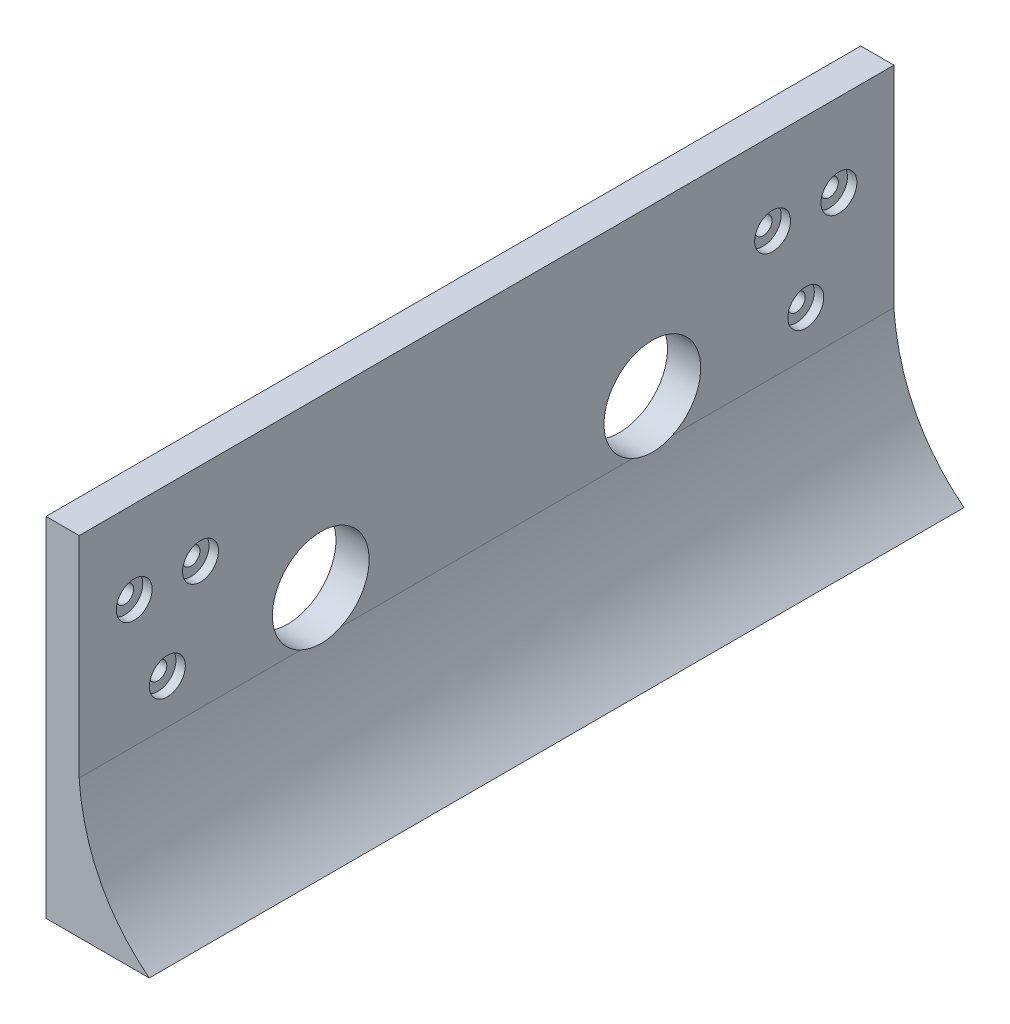
ISO-10303-21;
HEADER;
FILE_DESCRIPTION(('STEP AP214'),'2;1');
FILE_NAME('part.step','',(''),(''),'','','');
FILE_SCHEMA(('AUTOMOTIVE_DESIGN { 1 0 10303 214 1 1 1 1 }'));
ENDSEC;
DATA;
#1=APPLICATION_CONTEXT('core data for automotive mechanical design processes');
#2=APPLICATION_PROTOCOL_DEFINITION('international standard','automotive_design',2000,#1);
#3=PRODUCT_CONTEXT('',#1,'mechanical');
#4=PRODUCT('Part','Part','',(#3));
#5=PRODUCT_RELATED_PRODUCT_CATEGORY('part','',(#4));
#6=PRODUCT_DEFINITION_FORMATION('','',#4);
#7=PRODUCT_DEFINITION_CONTEXT('part definition',#1,'design');
#8=PRODUCT_DEFINITION('design','',#6,#7);
#9=PRODUCT_DEFINITION_SHAPE('','',#8);
#10=(LENGTH_UNIT() NAMED_UNIT(*) SI_UNIT(.MILLI.,.METRE.));
#11=(NAMED_UNIT(*) PLANE_ANGLE_UNIT() SI_UNIT($,.RADIAN.));
#12=(NAMED_UNIT(*) SI_UNIT($,.STERADIAN.) SOLID_ANGLE_UNIT());
#13=UNCERTAINTY_MEASURE_WITH_UNIT(LENGTH_MEASURE(1.E-05),#10,'distance_accuracy_value','');
#14=(GEOMETRIC_REPRESENTATION_CONTEXT(3) GLOBAL_UNCERTAINTY_ASSIGNED_CONTEXT((#13)) GLOBAL_UNIT_ASSIGNED_CONTEXT((#10,
#11,#12)) REPRESENTATION_CONTEXT('',''));
#15=CARTESIAN_POINT('',(0.,0.,0.));
#16=DIRECTION('',(0.,0.,1.));
#17=DIRECTION('',(1.,0.,0.));
#18=AXIS2_PLACEMENT_3D('',#15,#16,#17);
#19=CARTESIAN_POINT('',(92.7248750291424,42.,57.7615337539128));
#20=DIRECTION('',(-1.,0.,0.));
#21=DIRECTION('',(0.,0.,1.));
#22=AXIS2_PLACEMENT_3D('',#19,#20,#21);
#23=CYLINDRICAL_SURFACE('',#22,1.6);
#24=CARTESIAN_POINT('',(86.3248750291424,42.,57.7615337539128));
#25=DIRECTION('',(-1.,0.,0.));
#26=DIRECTION('',(0.,0.,1.));
#27=AXIS2_PLACEMENT_3D('',#24,#25,#26);
#28=CIRCLE('',#27,1.6);
#29=CARTESIAN_POINT('',(86.3248750291424,42.,59.3615337539128));
#30=VERTEX_POINT('',#29);
#31=EDGE_CURVE('E282',#30,#30,#28,.F.);
#32=ORIENTED_EDGE('',*,*,#31,.F.);
#33=EDGE_LOOP('',(#32));
#34=FACE_BOUND('',#33,.T.);
#35=CARTESIAN_POINT('',(90.6248750291424,42.,57.7615337539128));
#36=DIRECTION('',(1.,0.,0.));
#37=DIRECTION('',(0.,0.,-1.));
#38=AXIS2_PLACEMENT_3D('',#35,#36,#37);
#39=CIRCLE('',#38,1.6);
#40=CARTESIAN_POINT('',(90.6248750291424,42.,56.1615337539128));
#41=VERTEX_POINT('',#40);
#42=EDGE_CURVE('E548',#41,#41,#39,.T.);
#43=ORIENTED_EDGE('',*,*,#42,.T.);
#44=EDGE_LOOP('',(#43));
#45=FACE_BOUND('',#44,.T.);
#46=ADVANCED_FACE('F52',(#34,#45),#23,.F.);
#47=CARTESIAN_POINT('',(92.7248750291424,57.,63.7615337539128));
#48=DIRECTION('',(-1.,0.,0.));
#49=DIRECTION('',(0.,0.,1.));
#50=AXIS2_PLACEMENT_3D('',#47,#48,#49);
#51=CYLINDRICAL_SURFACE('',#50,1.60000000000001);
#52=CARTESIAN_POINT('',(86.3248750291424,57.,63.7615337539128));
#53=DIRECTION('',(-1.,0.,0.));
#54=DIRECTION('',(0.,0.,1.));
#55=AXIS2_PLACEMENT_3D('',#52,#53,#54);
#56=CIRCLE('',#55,1.60000000000001);
#57=CARTESIAN_POINT('',(86.3248750291424,57.,65.3615337539128));
#58=VERTEX_POINT('',#57);
#59=EDGE_CURVE('E279',#58,#58,#56,.F.);
#60=ORIENTED_EDGE('',*,*,#59,.F.);
#61=EDGE_LOOP('',(#60));
#62=FACE_BOUND('',#61,.T.);
#63=CARTESIAN_POINT('',(90.6248750291424,57.,63.7615337539128));
#64=DIRECTION('',(1.,0.,0.));
#65=DIRECTION('',(0.,0.,-1.));
#66=AXIS2_PLACEMENT_3D('',#63,#64,#65);
#67=CIRCLE('',#66,1.60000000000001);
#68=CARTESIAN_POINT('',(90.6248750291424,57.,62.1615337539128));
#69=VERTEX_POINT('',#68);
#70=EDGE_CURVE('E256',#69,#69,#67,.T.);
#71=ORIENTED_EDGE('',*,*,#70,.T.);
#72=EDGE_LOOP('',(#71));
#73=FACE_BOUND('',#72,.T.);
#74=ADVANCED_FACE('F178',(#62,#73),#51,.F.);
#75=CARTESIAN_POINT('',(92.7248750291424,57.,51.7615337539128));
#76=DIRECTION('',(-1.,0.,0.));
#77=DIRECTION('',(0.,0.,1.));
#78=AXIS2_PLACEMENT_3D('',#75,#76,#77);
#79=CYLINDRICAL_SURFACE('',#78,1.60000000000001);
#80=CARTESIAN_POINT('',(86.3248750291424,57.,51.7615337539128));
#81=DIRECTION('',(-1.,0.,0.));
#82=DIRECTION('',(0.,0.,1.));
#83=AXIS2_PLACEMENT_3D('',#80,#81,#82);
#84=CIRCLE('',#83,1.60000000000001);
#85=CARTESIAN_POINT('',(86.3248750291424,57.,53.3615337539128));
#86=VERTEX_POINT('',#85);
#87=EDGE_CURVE('E283',#86,#86,#84,.F.);
#88=ORIENTED_EDGE('',*,*,#87,.F.);
#89=EDGE_LOOP('',(#88));
#90=FACE_BOUND('',#89,.T.);
#91=CARTESIAN_POINT('',(90.6248750291424,57.,51.7615337539128));
#92=DIRECTION('',(1.,0.,0.));
#93=DIRECTION('',(0.,0.,-1.));
#94=AXIS2_PLACEMENT_3D('',#91,#92,#93);
#95=CIRCLE('',#94,1.60000000000001);
#96=CARTESIAN_POINT('',(90.6248750291424,57.,50.1615337539128));
#97=VERTEX_POINT('',#96);
#98=EDGE_CURVE('E549',#97,#97,#95,.T.);
#99=ORIENTED_EDGE('',*,*,#98,.T.);
#100=EDGE_LOOP('',(#99));
#101=FACE_BOUND('',#100,.T.);
#102=ADVANCED_FACE('F183',(#90,#101),#79,.F.);
#103=CARTESIAN_POINT('',(105.,9.,-73.7179107017961));
#104=CARTESIAN_POINT('',(93.4397317254562,18.2271976613418,-73.7179107017961));
#105=CARTESIAN_POINT('',(92.3248750291424,34.,-73.7179107017961));
#106=B_SPLINE_CURVE_WITH_KNOTS('',2,(#103,#104,#105),.UNSPECIFIED.,.F.,.F.,(3,3),(0.,1.),.UNSPECIFIED.);
#107=DIRECTION('',(0.,0.,1.));
#108=VECTOR('',#107,1.);
#109=SURFACE_OF_LINEAR_EXTRUSION('',#106,#108);
#110=DIRECTION('',(0.,0.,1.));
#111=VECTOR('',#110,1.);
#112=CARTESIAN_POINT('',(92.3248750291424,34.,-73.7179107017961));
#113=LINE('',#112,#111);
#114=CARTESIAN_POINT('',(92.3248750291424,34.,-73.7179107017961));
#115=VERTEX_POINT('',#114);
#116=CARTESIAN_POINT('',(92.3248750291424,34.,-33.5443617196896));
#117=VERTEX_POINT('',#116);
#118=EDGE_CURVE('E126',#115,#117,#113,.T.);
#119=ORIENTED_EDGE('',*,*,#118,.T.);
#120=CARTESIAN_POINT('',(92.3248750291424,34.,-33.5443617196896));
#121=CARTESIAN_POINT('',(92.3319106132641,33.9006090274986,-33.3200898688275));
#122=CARTESIAN_POINT('',(92.3385812050402,33.8106928153023,-33.0916108543302));
#123=CARTESIAN_POINT('',(92.3508617682079,33.6503430133056,-32.6278877371185));
#124=CARTESIAN_POINT('',(92.3564717402337,33.5799094118559,-32.3926436384492));
#125=CARTESIAN_POINT('',(92.366300735324,33.4590541499445,-31.917024904046));
#126=CARTESIAN_POINT('',(92.3705196740474,33.4086337028816,-31.6766499581592));
#127=CARTESIAN_POINT('',(92.3773348220622,33.3281694599186,-31.1925023488931));
#128=CARTESIAN_POINT('',(92.3799311085502,33.2981246946518,-30.9487298477146));
#129=CARTESIAN_POINT('',(92.3833581527275,33.2586119125735,-30.4593050437774));
#130=CARTESIAN_POINT('',(92.3841874338878,33.2491611041482,-30.2136513409309));
#131=CARTESIAN_POINT('',(92.384030638545,33.2509556636418,-29.7224201128998));
#132=CARTESIAN_POINT('',(92.3830445633017,33.2622010171973,-29.4768425876625));
#133=CARTESIAN_POINT('',(92.379313632492,33.3052781315904,-28.9878343601948));
#134=CARTESIAN_POINT('',(92.3765710507919,33.3370832774688,-28.7444012943092));
#135=CARTESIAN_POINT('',(92.369482857232,33.421007424925,-28.2611765949328));
#136=CARTESIAN_POINT('',(92.3651378393386,33.4731189000702,-28.0213836464251));
#137=CARTESIAN_POINT('',(92.3552913228563,33.5947185503601,-27.5568547255122));
#138=CARTESIAN_POINT('',(92.3498450113087,33.6633999938459,-27.3319059536168));
#139=CARTESIAN_POINT('',(92.3380006381269,33.8185142044853,-26.8885749240636));
#140=CARTESIAN_POINT('',(92.3316038460145,33.9049233511372,-26.6701843675524));
#141=CARTESIAN_POINT('',(92.3248750291424,34.,-26.4556382803107));
#142=B_SPLINE_CURVE_WITH_KNOTS('',3,(#120,#121,#122,#123,#124,#125,#126,#127,#128,#129,#130,
#131,#132,#133,#134,#135,#136,#137,#138,#139,#140,#141),.UNSPECIFIED.,.F.,.F.,(4,2,2,2,2,2,2,2,
2,2,4),(0.,0.736008665259869,1.47201689043756,2.20806973302774,2.94408755567597,
3.68072016206232,4.4173522572174,5.15303267553852,5.8884406768057,6.59346995340096,
7.29756587532268),.UNSPECIFIED.);
#143=CARTESIAN_POINT('',(92.3248750291424,34.,-26.4556382803107));
#144=VERTEX_POINT('',#143);
#145=EDGE_CURVE('E12',#117,#144,#142,.T.);
#146=ORIENTED_EDGE('',*,*,#145,.T.);
#147=CARTESIAN_POINT('',(92.3248750291424,34.,26.4556382803104));
#148=VERTEX_POINT('',#147);
#149=EDGE_CURVE('E119',#144,#148,#113,.T.);
#150=ORIENTED_EDGE('',*,*,#149,.T.);
#151=CARTESIAN_POINT('',(92.3248750291424,34.,26.4556382803104));
#152=CARTESIAN_POINT('',(92.3319106132641,33.9006090274986,26.6799101311725));
#153=CARTESIAN_POINT('',(92.3385812050402,33.8106928153023,26.9083891456698));
#154=CARTESIAN_POINT('',(92.3508617682079,33.6503430133056,27.3721122628815));
#155=CARTESIAN_POINT('',(92.3564717402337,33.5799094118559,27.6073563615507));
#156=CARTESIAN_POINT('',(92.366300735324,33.4590541499445,28.0829750959539));
#157=CARTESIAN_POINT('',(92.3705196740474,33.4086337028816,28.3233500418407));
#158=CARTESIAN_POINT('',(92.3773348220622,33.3281694599186,28.8074976511068));
#159=CARTESIAN_POINT('',(92.3799311085502,33.2981246946518,29.0512701522854));
#160=CARTESIAN_POINT('',(92.3833581527275,33.2586119125735,29.5406949562225));
#161=CARTESIAN_POINT('',(92.3841874338878,33.2491611041482,29.7863486590691));
#162=CARTESIAN_POINT('',(92.384030638545,33.2509556636417,30.2775798871002));
#163=CARTESIAN_POINT('',(92.3830445633017,33.2622010171973,30.5231574123375));
#164=CARTESIAN_POINT('',(92.379313632492,33.3052781315903,31.0121656398051));
#165=CARTESIAN_POINT('',(92.3765710507919,33.3370832774688,31.2555987056907));
#166=CARTESIAN_POINT('',(92.369482857232,33.421007424925,31.7388234050671));
#167=CARTESIAN_POINT('',(92.3651378393386,33.4731189000702,31.9786163535749));
#168=CARTESIAN_POINT('',(92.3552913228563,33.5947185503601,32.4431452744878));
#169=CARTESIAN_POINT('',(92.3498450113087,33.6633999938459,32.6680940463832));
#170=CARTESIAN_POINT('',(92.3380006381269,33.8185142044853,33.1114250759364));
#171=CARTESIAN_POINT('',(92.3316038460145,33.9049233511371,33.3298156324477));
#172=CARTESIAN_POINT('',(92.3248750291424,34.,33.5443617196894));
#173=B_SPLINE_CURVE_WITH_KNOTS('',3,(#151,#152,#153,#154,#155,#156,#157,#158,#159,#160,#161,
#162,#163,#164,#165,#166,#167,#168,#169,#170,#171,#172),.UNSPECIFIED.,.F.,.F.,(4,2,2,2,2,2,2,2,
2,2,4),(0.,0.736008665259872,1.47201689043755,2.20806973302774,2.94408755567597,
3.68072016206232,4.4173522572174,5.15303267553852,5.8884406768057,6.59346995340101,
7.29756587532278),.UNSPECIFIED.);
#174=CARTESIAN_POINT('',(92.3248750291424,34.,33.5443617196894));
#175=VERTEX_POINT('',#174);
#176=EDGE_CURVE('E61',#148,#175,#173,.T.);
#177=ORIENTED_EDGE('',*,*,#176,.T.);
#178=CARTESIAN_POINT('',(92.3248750291424,34.,73.7179107017961));
#179=VERTEX_POINT('',#178);
#180=EDGE_CURVE('E121',#175,#179,#113,.T.);
#181=ORIENTED_EDGE('',*,*,#180,.T.);
#182=CARTESIAN_POINT('',(105.,9.,73.7179107017961));
#183=CARTESIAN_POINT('',(93.4397317254562,18.2271976613418,73.7179107017961));
#184=CARTESIAN_POINT('',(92.3248750291424,34.,73.7179107017961));
#185=B_SPLINE_CURVE_WITH_KNOTS('',2,(#182,#183,#184),.UNSPECIFIED.,.F.,.F.,(3,3),(0.,1.),.UNSPECIFIED.);
#186=CARTESIAN_POINT('',(105.,9.,73.7179107017961));
#187=VERTEX_POINT('',#186);
#188=EDGE_CURVE('E312',#187,#179,#185,.T.);
#189=ORIENTED_EDGE('',*,*,#188,.F.);
#190=DIRECTION('',(0.,0.,1.));
#191=VECTOR('',#190,1.);
#192=CARTESIAN_POINT('',(105.,9.,-73.7179107017961));
#193=LINE('',#192,#191);
#194=CARTESIAN_POINT('',(105.,9.,-73.7179107017961));
#195=VERTEX_POINT('',#194);
#196=EDGE_CURVE('E129',#195,#187,#193,.T.);
#197=ORIENTED_EDGE('',*,*,#196,.F.);
#198=EDGE_CURVE('E328',#195,#115,#106,.T.);
#199=ORIENTED_EDGE('',*,*,#198,.T.);
#200=EDGE_LOOP('',(#119,#146,#150,#177,#181,#189,#197,#199));
#201=FACE_BOUND('',#200,.T.);
#202=ADVANCED_FACE('F125',(#201),#109,.T.);
#203=CARTESIAN_POINT('',(86.3248750291424,0.,-73.7179107017961));
#204=DIRECTION('',(-1.,0.,0.));
#205=DIRECTION('',(0.,0.,1.));
#206=AXIS2_PLACEMENT_3D('',#203,#204,#205);
#207=PLANE('',#206);
#208=CARTESIAN_POINT('',(86.3248750291424,42.,-57.7615337539128));
#209=DIRECTION('',(-1.,0.,0.));
#210=DIRECTION('',(0.,0.,1.));
#211=AXIS2_PLACEMENT_3D('',#208,#209,#210);
#212=CIRCLE('',#211,1.6);
#213=CARTESIAN_POINT('',(86.3248750291424,42.,-56.1615337539128));
#214=VERTEX_POINT('',#213);
#215=EDGE_CURVE('E292',#214,#214,#212,.F.);
#216=ORIENTED_EDGE('',*,*,#215,.T.);
#217=EDGE_LOOP('',(#216));
#218=FACE_BOUND('',#217,.T.);
#219=CARTESIAN_POINT('',(86.3248750291424,57.,-63.7615337539128));
#220=DIRECTION('',(-1.,0.,0.));
#221=DIRECTION('',(0.,0.,1.));
#222=AXIS2_PLACEMENT_3D('',#219,#220,#221);
#223=CIRCLE('',#222,1.60000000000001);
#224=CARTESIAN_POINT('',(86.3248750291424,57.,-62.1615337539128));
#225=VERTEX_POINT('',#224);
#226=EDGE_CURVE('E289',#225,#225,#223,.F.);
#227=ORIENTED_EDGE('',*,*,#226,.T.);
#228=EDGE_LOOP('',(#227));
#229=FACE_BOUND('',#228,.T.);
#230=CARTESIAN_POINT('',(86.3248750291424,57.,-51.7615337539128));
#231=DIRECTION('',(-1.,0.,0.));
#232=DIRECTION('',(0.,0.,1.));
#233=AXIS2_PLACEMENT_3D('',#230,#231,#232);
#234=CIRCLE('',#233,1.60000000000001);
#235=CARTESIAN_POINT('',(86.3248750291424,57.,-50.1615337539128));
#236=VERTEX_POINT('',#235);
#237=EDGE_CURVE('E286',#236,#236,#234,.F.);
#238=ORIENTED_EDGE('',*,*,#237,.T.);
#239=EDGE_LOOP('',(#238));
#240=FACE_BOUND('',#239,.T.);
#241=ORIENTED_EDGE('',*,*,#87,.T.);
#242=EDGE_LOOP('',(#241));
#243=FACE_BOUND('',#242,.T.);
#244=ORIENTED_EDGE('',*,*,#59,.T.);
#245=EDGE_LOOP('',(#244));
#246=FACE_BOUND('',#245,.T.);
#247=ORIENTED_EDGE('',*,*,#31,.T.);
#248=EDGE_LOOP('',(#247));
#249=FACE_BOUND('',#248,.T.);
#250=CARTESIAN_POINT('',(86.3248750291424,42.,-30.0000000000001));
#251=DIRECTION('',(-1.,0.,0.));
#252=DIRECTION('',(0.,0.,1.));
#253=AXIS2_PLACEMENT_3D('',#250,#251,#252);
#254=CIRCLE('',#253,8.74999999999999);
#255=CARTESIAN_POINT('',(86.3248750291424,42.,-21.2500000000001));
#256=VERTEX_POINT('',#255);
#257=EDGE_CURVE('E122',#256,#256,#254,.F.);
#258=ORIENTED_EDGE('',*,*,#257,.T.);
#259=EDGE_LOOP('',(#258));
#260=FACE_BOUND('',#259,.T.);
#261=CARTESIAN_POINT('',(86.3248750291424,42.,29.9999999999999));
#262=DIRECTION('',(-1.,0.,0.));
#263=DIRECTION('',(0.,0.,1.));
#264=AXIS2_PLACEMENT_3D('',#261,#262,#263);
#265=CIRCLE('',#264,8.75);
#266=CARTESIAN_POINT('',(86.3248750291424,42.,38.7499999999999));
#267=VERTEX_POINT('',#266);
#268=EDGE_CURVE('E297',#267,#267,#265,.F.);
#269=ORIENTED_EDGE('',*,*,#268,.T.);
#270=EDGE_LOOP('',(#269));
#271=FACE_BOUND('',#270,.T.);
#272=DIRECTION('',(0.,0.,1.));
#273=VECTOR('',#272,1.);
#274=CARTESIAN_POINT('',(86.3248750291424,9.,-73.7179107017961));
#275=LINE('',#274,#273);
#276=CARTESIAN_POINT('',(86.3248750291424,9.,-73.7179107017961));
#277=VERTEX_POINT('',#276);
#278=CARTESIAN_POINT('',(86.3248750291424,9.,73.7179107017961));
#279=VERTEX_POINT('',#278);
#280=EDGE_CURVE('E134',#277,#279,#275,.T.);
#281=ORIENTED_EDGE('',*,*,#280,.T.);
#282=DIRECTION('',(0.,-1.,0.));
#283=VECTOR('',#282,1.);
#284=CARTESIAN_POINT('',(86.3248750291424,0.,73.7179107017961));
#285=LINE('',#284,#283);
#286=CARTESIAN_POINT('',(86.3248750291424,72.,73.7179107017961));
#287=VERTEX_POINT('',#286);
#288=EDGE_CURVE('E303',#287,#279,#285,.T.);
#289=ORIENTED_EDGE('',*,*,#288,.F.);
#290=DIRECTION('',(0.,0.,1.));
#291=VECTOR('',#290,1.);
#292=CARTESIAN_POINT('',(86.3248750291424,72.,-73.7179107017961));
#293=LINE('',#292,#291);
#294=CARTESIAN_POINT('',(86.3248750291424,72.,-73.7179107017961));
#295=VERTEX_POINT('',#294);
#296=EDGE_CURVE('E114',#295,#287,#293,.T.);
#297=ORIENTED_EDGE('',*,*,#296,.F.);
#298=DIRECTION('',(0.,-1.,0.));
#299=VECTOR('',#298,1.);
#300=CARTESIAN_POINT('',(86.3248750291424,0.,-73.7179107017961));
#301=LINE('',#300,#299);
#302=EDGE_CURVE('E323',#295,#277,#301,.T.);
#303=ORIENTED_EDGE('',*,*,#302,.T.);
#304=EDGE_LOOP('',(#281,#289,#297,#303));
#305=FACE_BOUND('',#304,.T.);
#306=ADVANCED_FACE('F54',(#218,#229,#240,#243,#246,#249,#260,#271,#305),#207,.T.);
#307=CARTESIAN_POINT('',(0.,72.,-73.7179107017961));
#308=DIRECTION('',(0.,1.,0.));
#309=DIRECTION('',(0.,0.,1.));
#310=AXIS2_PLACEMENT_3D('',#307,#308,#309);
#311=PLANE('',#310);
#312=ORIENTED_EDGE('',*,*,#296,.T.);
#313=DIRECTION('',(-1.,0.,0.));
#314=VECTOR('',#313,1.);
#315=CARTESIAN_POINT('',(0.,72.,73.7179107017961));
#316=LINE('',#315,#314);
#317=CARTESIAN_POINT('',(92.3248750291424,72.,73.7179107017961));
#318=VERTEX_POINT('',#317);
#319=EDGE_CURVE('E306',#318,#287,#316,.T.);
#320=ORIENTED_EDGE('',*,*,#319,.F.);
#321=DIRECTION('',(0.,0.,1.));
#322=VECTOR('',#321,1.);
#323=CARTESIAN_POINT('',(92.3248750291424,72.,-73.7179107017961));
#324=LINE('',#323,#322);
#325=CARTESIAN_POINT('',(92.3248750291424,72.,-73.7179107017961));
#326=VERTEX_POINT('',#325);
#327=EDGE_CURVE('E128',#326,#318,#324,.T.);
#328=ORIENTED_EDGE('',*,*,#327,.F.);
#329=DIRECTION('',(-1.,0.,0.));
#330=VECTOR('',#329,1.);
#331=CARTESIAN_POINT('',(0.,72.,-73.7179107017961));
#332=LINE('',#331,#330);
#333=EDGE_CURVE('E135',#326,#295,#332,.T.);
#334=ORIENTED_EDGE('',*,*,#333,.T.);
#335=EDGE_LOOP('',(#312,#320,#328,#334));
#336=FACE_BOUND('',#335,.T.);
#337=ADVANCED_FACE('F166',(#336),#311,.T.);
#338=CARTESIAN_POINT('',(92.3248750291424,0.,-73.7179107017961));
#339=DIRECTION('',(1.,0.,0.));
#340=DIRECTION('',(0.,0.,-1.));
#341=AXIS2_PLACEMENT_3D('',#338,#339,#340);
#342=PLANE('',#341);
#343=CARTESIAN_POINT('',(92.3248750291424,42.,-57.7615337539128));
#344=DIRECTION('',(1.,0.,0.));
#345=DIRECTION('',(0.,0.,-1.));
#346=AXIS2_PLACEMENT_3D('',#343,#344,#345);
#347=CIRCLE('',#346,3.25);
#348=CARTESIAN_POINT('',(92.3248750291424,42.,-61.0115337539128));
#349=VERTEX_POINT('',#348);
#350=EDGE_CURVE('E56',#349,#349,#347,.T.);
#351=ORIENTED_EDGE('',*,*,#350,.F.);
#352=EDGE_LOOP('',(#351));
#353=FACE_BOUND('',#352,.T.);
#354=CARTESIAN_POINT('',(92.3248750291424,57.,-63.7615337539128));
#355=DIRECTION('',(1.,0.,0.));
#356=DIRECTION('',(0.,0.,-1.));
#357=AXIS2_PLACEMENT_3D('',#354,#355,#356);
#358=CIRCLE('',#357,3.25000000000001);
#359=CARTESIAN_POINT('',(92.3248750291424,57.,-67.0115337539128));
#360=VERTEX_POINT('',#359);
#361=EDGE_CURVE('E569',#360,#360,#358,.T.);
#362=ORIENTED_EDGE('',*,*,#361,.F.);
#363=EDGE_LOOP('',(#362));
#364=FACE_BOUND('',#363,.T.);
#365=CARTESIAN_POINT('',(92.3248750291424,57.,-51.7615337539128));
#366=DIRECTION('',(1.,0.,0.));
#367=DIRECTION('',(0.,0.,-1.));
#368=AXIS2_PLACEMENT_3D('',#365,#366,#367);
#369=CIRCLE('',#368,3.25);
#370=CARTESIAN_POINT('',(92.3248750291424,57.,-55.0115337539128));
#371=VERTEX_POINT('',#370);
#372=EDGE_CURVE('E567',#371,#371,#369,.T.);
#373=ORIENTED_EDGE('',*,*,#372,.F.);
#374=EDGE_LOOP('',(#373));
#375=FACE_BOUND('',#374,.T.);
#376=CARTESIAN_POINT('',(92.3248750291424,57.,51.7615337539128));
#377=DIRECTION('',(1.,0.,0.));
#378=DIRECTION('',(0.,0.,-1.));
#379=AXIS2_PLACEMENT_3D('',#376,#377,#378);
#380=CIRCLE('',#379,3.25);
#381=CARTESIAN_POINT('',(92.3248750291424,57.,48.5115337539128));
#382=VERTEX_POINT('',#381);
#383=EDGE_CURVE('E564',#382,#382,#380,.T.);
#384=ORIENTED_EDGE('',*,*,#383,.F.);
#385=EDGE_LOOP('',(#384));
#386=FACE_BOUND('',#385,.T.);
#387=CARTESIAN_POINT('',(92.3248750291424,57.,63.7615337539128));
#388=DIRECTION('',(1.,0.,0.));
#389=DIRECTION('',(0.,0.,-1.));
#390=AXIS2_PLACEMENT_3D('',#387,#388,#389);
#391=CIRCLE('',#390,3.25);
#392=CARTESIAN_POINT('',(92.3248750291424,57.,60.5115337539128));
#393=VERTEX_POINT('',#392);
#394=EDGE_CURVE('E561',#393,#393,#391,.T.);
#395=ORIENTED_EDGE('',*,*,#394,.F.);
#396=EDGE_LOOP('',(#395));
#397=FACE_BOUND('',#396,.T.);
#398=CARTESIAN_POINT('',(92.3248750291424,42.,57.7615337539128));
#399=DIRECTION('',(1.,0.,0.));
#400=DIRECTION('',(0.,0.,-1.));
#401=AXIS2_PLACEMENT_3D('',#398,#399,#400);
#402=CIRCLE('',#401,3.25);
#403=CARTESIAN_POINT('',(92.3248750291424,42.,54.5115337539128));
#404=VERTEX_POINT('',#403);
#405=EDGE_CURVE('E552',#404,#404,#402,.T.);
#406=ORIENTED_EDGE('',*,*,#405,.F.);
#407=EDGE_LOOP('',(#406));
#408=FACE_BOUND('',#407,.T.);
#409=ORIENTED_EDGE('',*,*,#149,.F.);
#410=CARTESIAN_POINT('',(92.3248750291424,42.,-30.0000000000001));
#411=DIRECTION('',(1.,0.,0.));
#412=DIRECTION('',(0.,0.,-1.));
#413=AXIS2_PLACEMENT_3D('',#410,#411,#412);
#414=CIRCLE('',#413,8.74999999999999);
#415=EDGE_CURVE('E75',#144,#117,#414,.F.);
#416=ORIENTED_EDGE('',*,*,#415,.T.);
#417=ORIENTED_EDGE('',*,*,#118,.F.);
#418=DIRECTION('',(0.,1.,0.));
#419=VECTOR('',#418,1.);
#420=CARTESIAN_POINT('',(92.3248750291424,0.,-73.7179107017961));
#421=LINE('',#420,#419);
#422=EDGE_CURVE('E334',#115,#326,#421,.T.);
#423=ORIENTED_EDGE('',*,*,#422,.T.);
#424=ORIENTED_EDGE('',*,*,#327,.T.);
#425=DIRECTION('',(0.,1.,0.));
#426=VECTOR('',#425,1.);
#427=CARTESIAN_POINT('',(92.3248750291424,0.,73.7179107017961));
#428=LINE('',#427,#426);
#429=EDGE_CURVE('E309',#179,#318,#428,.T.);
#430=ORIENTED_EDGE('',*,*,#429,.F.);
#431=ORIENTED_EDGE('',*,*,#180,.F.);
#432=CARTESIAN_POINT('',(92.3248750291424,42.,29.9999999999999));
#433=DIRECTION('',(1.,0.,0.));
#434=DIRECTION('',(0.,0.,-1.));
#435=AXIS2_PLACEMENT_3D('',#432,#433,#434);
#436=CIRCLE('',#435,8.75);
#437=EDGE_CURVE('E68',#175,#148,#436,.F.);
#438=ORIENTED_EDGE('',*,*,#437,.T.);
#439=EDGE_LOOP('',(#409,#416,#417,#423,#424,#430,#431,#438));
#440=FACE_BOUND('',#439,.T.);
#441=ADVANCED_FACE('F118',(#353,#364,#375,#386,#397,#408,#440),#342,.T.);
#442=CARTESIAN_POINT('',(0.,9.,-73.7179107017961));
#443=DIRECTION('',(0.,-1.,0.));
#444=DIRECTION('',(0.,0.,-1.));
#445=AXIS2_PLACEMENT_3D('',#442,#443,#444);
#446=PLANE('',#445);
#447=ORIENTED_EDGE('',*,*,#196,.T.);
#448=DIRECTION('',(1.,0.,0.));
#449=VECTOR('',#448,1.);
#450=CARTESIAN_POINT('',(0.,9.,73.7179107017961));
#451=LINE('',#450,#449);
#452=EDGE_CURVE('E317',#279,#187,#451,.T.);
#453=ORIENTED_EDGE('',*,*,#452,.F.);
#454=ORIENTED_EDGE('',*,*,#280,.F.);
#455=DIRECTION('',(1.,0.,0.));
#456=VECTOR('',#455,1.);
#457=CARTESIAN_POINT('',(0.,9.,-73.7179107017961));
#458=LINE('',#457,#456);
#459=EDGE_CURVE('E326',#277,#195,#458,.T.);
#460=ORIENTED_EDGE('',*,*,#459,.T.);
#461=EDGE_LOOP('',(#447,#453,#454,#460));
#462=FACE_BOUND('',#461,.T.);
#463=ADVANCED_FACE('F164',(#462),#446,.T.);
#464=CARTESIAN_POINT('',(0.,0.,-73.7179107017961));
#465=DIRECTION('',(0.,0.,1.));
#466=DIRECTION('',(1.,0.,0.));
#467=AXIS2_PLACEMENT_3D('',#464,#465,#466);
#468=PLANE('',#467);
#469=ORIENTED_EDGE('',*,*,#302,.F.);
#470=ORIENTED_EDGE('',*,*,#333,.F.);
#471=ORIENTED_EDGE('',*,*,#422,.F.);
#472=ORIENTED_EDGE('',*,*,#198,.F.);
#473=ORIENTED_EDGE('',*,*,#459,.F.);
#474=EDGE_LOOP('',(#469,#470,#471,#472,#473));
#475=FACE_BOUND('',#474,.T.);
#476=ADVANCED_FACE('F160',(#475),#468,.F.);
#477=CARTESIAN_POINT('',(0.,0.,73.7179107017961));
#478=DIRECTION('',(0.,0.,-1.));
#479=DIRECTION('',(1.,0.,0.));
#480=AXIS2_PLACEMENT_3D('',#477,#478,#479);
#481=PLANE('',#480);
#482=ORIENTED_EDGE('',*,*,#288,.T.);
#483=ORIENTED_EDGE('',*,*,#452,.T.);
#484=ORIENTED_EDGE('',*,*,#188,.T.);
#485=ORIENTED_EDGE('',*,*,#429,.T.);
#486=ORIENTED_EDGE('',*,*,#319,.T.);
#487=EDGE_LOOP('',(#482,#483,#484,#485,#486));
#488=FACE_BOUND('',#487,.T.);
#489=ADVANCED_FACE('F155',(#488),#481,.F.);
#490=CARTESIAN_POINT('',(92.7248750291424,42.,29.9999999999999));
#491=DIRECTION('',(-1.,0.,0.));
#492=DIRECTION('',(0.,0.,1.));
#493=AXIS2_PLACEMENT_3D('',#490,#491,#492);
#494=CYLINDRICAL_SURFACE('',#493,8.75);
#495=ORIENTED_EDGE('',*,*,#176,.F.);
#496=ORIENTED_EDGE('',*,*,#437,.F.);
#497=EDGE_LOOP('',(#495,#496));
#498=FACE_BOUND('',#497,.T.);
#499=ORIENTED_EDGE('',*,*,#268,.F.);
#500=EDGE_LOOP('',(#499));
#501=FACE_BOUND('',#500,.T.);
#502=ADVANCED_FACE('F109',(#498,#501),#494,.F.);
#503=CARTESIAN_POINT('',(92.7248750291424,42.,-30.0000000000001));
#504=DIRECTION('',(-1.,0.,0.));
#505=DIRECTION('',(0.,0.,1.));
#506=AXIS2_PLACEMENT_3D('',#503,#504,#505);
#507=CYLINDRICAL_SURFACE('',#506,8.74999999999999);
#508=ORIENTED_EDGE('',*,*,#145,.F.);
#509=ORIENTED_EDGE('',*,*,#415,.F.);
#510=EDGE_LOOP('',(#508,#509));
#511=FACE_BOUND('',#510,.T.);
#512=ORIENTED_EDGE('',*,*,#257,.F.);
#513=EDGE_LOOP('',(#512));
#514=FACE_BOUND('',#513,.T.);
#515=ADVANCED_FACE('F154',(#511,#514),#507,.F.);
#516=CARTESIAN_POINT('',(92.7248750291424,57.,-51.7615337539128));
#517=DIRECTION('',(-1.,0.,0.));
#518=DIRECTION('',(0.,0.,1.));
#519=AXIS2_PLACEMENT_3D('',#516,#517,#518);
#520=CYLINDRICAL_SURFACE('',#519,1.60000000000001);
#521=CARTESIAN_POINT('',(90.6248750291424,57.,-51.7615337539128));
#522=DIRECTION('',(-1.,0.,0.));
#523=DIRECTION('',(0.,0.,1.));
#524=AXIS2_PLACEMENT_3D('',#521,#522,#523);
#525=CIRCLE('',#524,1.60000000000001);
#526=CARTESIAN_POINT('',(90.6248750291424,57.,-50.1615337539128));
#527=VERTEX_POINT('',#526);
#528=EDGE_CURVE('E555',#527,#527,#525,.T.);
#529=ORIENTED_EDGE('',*,*,#528,.F.);
#530=EDGE_LOOP('',(#529));
#531=FACE_BOUND('',#530,.T.);
#532=ORIENTED_EDGE('',*,*,#237,.F.);
#533=EDGE_LOOP('',(#532));
#534=FACE_BOUND('',#533,.T.);
#535=ADVANCED_FACE('F197',(#531,#534),#520,.F.);
#536=CARTESIAN_POINT('',(92.7248750291424,57.,-63.7615337539128));
#537=DIRECTION('',(-1.,0.,0.));
#538=DIRECTION('',(0.,0.,1.));
#539=AXIS2_PLACEMENT_3D('',#536,#537,#538);
#540=CYLINDRICAL_SURFACE('',#539,1.60000000000001);
#541=CARTESIAN_POINT('',(90.6248750291424,57.,-63.7615337539128));
#542=DIRECTION('',(-1.,0.,0.));
#543=DIRECTION('',(0.,0.,1.));
#544=AXIS2_PLACEMENT_3D('',#541,#542,#543);
#545=CIRCLE('',#544,1.60000000000001);
#546=CARTESIAN_POINT('',(90.6248750291424,57.,-62.1615337539128));
#547=VERTEX_POINT('',#546);
#548=EDGE_CURVE('E598',#547,#547,#545,.T.);
#549=ORIENTED_EDGE('',*,*,#548,.F.);
#550=EDGE_LOOP('',(#549));
#551=FACE_BOUND('',#550,.T.);
#552=ORIENTED_EDGE('',*,*,#226,.F.);
#553=EDGE_LOOP('',(#552));
#554=FACE_BOUND('',#553,.T.);
#555=ADVANCED_FACE('F193',(#551,#554),#540,.F.);
#556=CARTESIAN_POINT('',(92.7248750291424,42.,-57.7615337539128));
#557=DIRECTION('',(-1.,0.,0.));
#558=DIRECTION('',(0.,0.,1.));
#559=AXIS2_PLACEMENT_3D('',#556,#557,#558);
#560=CYLINDRICAL_SURFACE('',#559,1.6);
#561=CARTESIAN_POINT('',(90.6248750291424,42.,-57.7615337539128));
#562=DIRECTION('',(-1.,0.,0.));
#563=DIRECTION('',(0.,0.,1.));
#564=AXIS2_PLACEMENT_3D('',#561,#562,#563);
#565=CIRCLE('',#564,1.6);
#566=CARTESIAN_POINT('',(90.6248750291424,42.,-56.1615337539128));
#567=VERTEX_POINT('',#566);
#568=EDGE_CURVE('E265',#567,#567,#565,.T.);
#569=ORIENTED_EDGE('',*,*,#568,.F.);
#570=EDGE_LOOP('',(#569));
#571=FACE_BOUND('',#570,.T.);
#572=ORIENTED_EDGE('',*,*,#215,.F.);
#573=EDGE_LOOP('',(#572));
#574=FACE_BOUND('',#573,.T.);
#575=ADVANCED_FACE('F189',(#571,#574),#560,.F.);
#576=CARTESIAN_POINT('',(90.6248750291424,42.,-57.7615337539128));
#577=DIRECTION('',(1.,0.,0.));
#578=DIRECTION('',(0.,0.,-1.));
#579=AXIS2_PLACEMENT_3D('',#576,#577,#578);
#580=CYLINDRICAL_SURFACE('',#579,3.25);
#581=ORIENTED_EDGE('',*,*,#350,.T.);
#582=EDGE_LOOP('',(#581));
#583=FACE_BOUND('',#582,.T.);
#584=CARTESIAN_POINT('',(90.6248750291424,42.,-57.7615337539128));
#585=DIRECTION('',(1.,0.,0.));
#586=DIRECTION('',(0.,0.,1.));
#587=AXIS2_PLACEMENT_3D('',#584,#585,#586);
#588=CIRCLE('',#587,3.25);
#589=CARTESIAN_POINT('',(90.6248750291424,42.,-54.5115337539128));
#590=VERTEX_POINT('',#589);
#591=EDGE_CURVE('E276',#590,#590,#588,.T.);
#592=ORIENTED_EDGE('',*,*,#591,.F.);
#593=EDGE_LOOP('',(#592));
#594=FACE_BOUND('',#593,.T.);
#595=ADVANCED_FACE('F192',(#583,#594),#580,.F.);
#596=CARTESIAN_POINT('',(90.6248750291424,42.,-57.7615337539128));
#597=DIRECTION('',(-1.,0.,0.));
#598=DIRECTION('',(0.,0.,1.));
#599=AXIS2_PLACEMENT_3D('',#596,#597,#598);
#600=PLANE('',#599);
#601=ORIENTED_EDGE('',*,*,#568,.T.);
#602=EDGE_LOOP('',(#601));
#603=FACE_BOUND('',#602,.T.);
#604=ORIENTED_EDGE('',*,*,#591,.T.);
#605=EDGE_LOOP('',(#604));
#606=FACE_BOUND('',#605,.T.);
#607=ADVANCED_FACE('F216',(#603,#606),#600,.F.);
#608=CARTESIAN_POINT('',(90.6248750291424,57.,-63.7615337539128));
#609=DIRECTION('',(1.,0.,0.));
#610=DIRECTION('',(0.,0.,-1.));
#611=AXIS2_PLACEMENT_3D('',#608,#609,#610);
#612=CYLINDRICAL_SURFACE('',#611,3.25000000000001);
#613=ORIENTED_EDGE('',*,*,#361,.T.);
#614=EDGE_LOOP('',(#613));
#615=FACE_BOUND('',#614,.T.);
#616=CARTESIAN_POINT('',(90.6248750291424,57.,-63.7615337539128));
#617=DIRECTION('',(1.,0.,0.));
#618=DIRECTION('',(0.,0.,1.));
#619=AXIS2_PLACEMENT_3D('',#616,#617,#618);
#620=CIRCLE('',#619,3.25000000000001);
#621=CARTESIAN_POINT('',(90.6248750291424,57.,-60.5115337539128));
#622=VERTEX_POINT('',#621);
#623=EDGE_CURVE('E273',#622,#622,#620,.T.);
#624=ORIENTED_EDGE('',*,*,#623,.F.);
#625=EDGE_LOOP('',(#624));
#626=FACE_BOUND('',#625,.T.);
#627=ADVANCED_FACE('F220',(#615,#626),#612,.F.);
#628=CARTESIAN_POINT('',(90.6248750291424,57.,-63.7615337539128));
#629=DIRECTION('',(-1.,0.,0.));
#630=DIRECTION('',(0.,0.,1.));
#631=AXIS2_PLACEMENT_3D('',#628,#629,#630);
#632=PLANE('',#631);
#633=ORIENTED_EDGE('',*,*,#548,.T.);
#634=EDGE_LOOP('',(#633));
#635=FACE_BOUND('',#634,.T.);
#636=ORIENTED_EDGE('',*,*,#623,.T.);
#637=EDGE_LOOP('',(#636));
#638=FACE_BOUND('',#637,.T.);
#639=ADVANCED_FACE('F224',(#635,#638),#632,.F.);
#640=CARTESIAN_POINT('',(90.6248750291424,57.,-51.7615337539128));
#641=DIRECTION('',(1.,0.,0.));
#642=DIRECTION('',(0.,0.,-1.));
#643=AXIS2_PLACEMENT_3D('',#640,#641,#642);
#644=CYLINDRICAL_SURFACE('',#643,3.25);
#645=ORIENTED_EDGE('',*,*,#372,.T.);
#646=EDGE_LOOP('',(#645));
#647=FACE_BOUND('',#646,.T.);
#648=CARTESIAN_POINT('',(90.6248750291424,57.,-51.7615337539128));
#649=DIRECTION('',(1.,0.,0.));
#650=DIRECTION('',(0.,0.,1.));
#651=AXIS2_PLACEMENT_3D('',#648,#649,#650);
#652=CIRCLE('',#651,3.25);
#653=CARTESIAN_POINT('',(90.6248750291424,57.,-48.5115337539128));
#654=VERTEX_POINT('',#653);
#655=EDGE_CURVE('E268',#654,#654,#652,.T.);
#656=ORIENTED_EDGE('',*,*,#655,.F.);
#657=EDGE_LOOP('',(#656));
#658=FACE_BOUND('',#657,.T.);
#659=ADVANCED_FACE('F228',(#647,#658),#644,.F.);
#660=CARTESIAN_POINT('',(90.6248750291424,57.,-51.7615337539128));
#661=DIRECTION('',(-1.,0.,0.));
#662=DIRECTION('',(0.,0.,1.));
#663=AXIS2_PLACEMENT_3D('',#660,#661,#662);
#664=PLANE('',#663);
#665=ORIENTED_EDGE('',*,*,#528,.T.);
#666=EDGE_LOOP('',(#665));
#667=FACE_BOUND('',#666,.T.);
#668=ORIENTED_EDGE('',*,*,#655,.T.);
#669=EDGE_LOOP('',(#668));
#670=FACE_BOUND('',#669,.T.);
#671=ADVANCED_FACE('F232',(#667,#670),#664,.F.);
#672=CARTESIAN_POINT('',(90.6248750291424,57.,51.7615337539128));
#673=DIRECTION('',(1.,0.,0.));
#674=DIRECTION('',(0.,0.,-1.));
#675=AXIS2_PLACEMENT_3D('',#672,#673,#674);
#676=CYLINDRICAL_SURFACE('',#675,3.25);
#677=ORIENTED_EDGE('',*,*,#383,.T.);
#678=EDGE_LOOP('',(#677));
#679=FACE_BOUND('',#678,.T.);
#680=CARTESIAN_POINT('',(90.6248750291424,57.,51.7615337539128));
#681=DIRECTION('',(1.,0.,0.));
#682=DIRECTION('',(0.,0.,-1.));
#683=AXIS2_PLACEMENT_3D('',#680,#681,#682);
#684=CIRCLE('',#683,3.25);
#685=CARTESIAN_POINT('',(90.6248750291424,57.,48.5115337539128));
#686=VERTEX_POINT('',#685);
#687=EDGE_CURVE('E262',#686,#686,#684,.T.);
#688=ORIENTED_EDGE('',*,*,#687,.F.);
#689=EDGE_LOOP('',(#688));
#690=FACE_BOUND('',#689,.T.);
#691=ADVANCED_FACE('F236',(#679,#690),#676,.F.);
#692=CARTESIAN_POINT('',(90.6248750291424,57.,51.7615337539128));
#693=DIRECTION('',(1.,0.,0.));
#694=DIRECTION('',(0.,0.,-1.));
#695=AXIS2_PLACEMENT_3D('',#692,#693,#694);
#696=PLANE('',#695);
#697=ORIENTED_EDGE('',*,*,#98,.F.);
#698=EDGE_LOOP('',(#697));
#699=FACE_BOUND('',#698,.T.);
#700=ORIENTED_EDGE('',*,*,#687,.T.);
#701=EDGE_LOOP('',(#700));
#702=FACE_BOUND('',#701,.T.);
#703=ADVANCED_FACE('F240',(#699,#702),#696,.T.);
#704=CARTESIAN_POINT('',(90.6248750291424,57.,63.7615337539128));
#705=DIRECTION('',(1.,0.,0.));
#706=DIRECTION('',(0.,0.,-1.));
#707=AXIS2_PLACEMENT_3D('',#704,#705,#706);
#708=CYLINDRICAL_SURFACE('',#707,3.25);
#709=ORIENTED_EDGE('',*,*,#394,.T.);
#710=EDGE_LOOP('',(#709));
#711=FACE_BOUND('',#710,.T.);
#712=CARTESIAN_POINT('',(90.6248750291424,57.,63.7615337539128));
#713=DIRECTION('',(1.,0.,0.));
#714=DIRECTION('',(0.,0.,-1.));
#715=AXIS2_PLACEMENT_3D('',#712,#713,#714);
#716=CIRCLE('',#715,3.25);
#717=CARTESIAN_POINT('',(90.6248750291424,57.,60.5115337539128));
#718=VERTEX_POINT('',#717);
#719=EDGE_CURVE('E259',#718,#718,#716,.T.);
#720=ORIENTED_EDGE('',*,*,#719,.F.);
#721=EDGE_LOOP('',(#720));
#722=FACE_BOUND('',#721,.T.);
#723=ADVANCED_FACE('F244',(#711,#722),#708,.F.);
#724=CARTESIAN_POINT('',(90.6248750291424,57.,63.7615337539128));
#725=DIRECTION('',(1.,0.,0.));
#726=DIRECTION('',(0.,0.,-1.));
#727=AXIS2_PLACEMENT_3D('',#724,#725,#726);
#728=PLANE('',#727);
#729=ORIENTED_EDGE('',*,*,#70,.F.);
#730=EDGE_LOOP('',(#729));
#731=FACE_BOUND('',#730,.T.);
#732=ORIENTED_EDGE('',*,*,#719,.T.);
#733=EDGE_LOOP('',(#732));
#734=FACE_BOUND('',#733,.T.);
#735=ADVANCED_FACE('F209',(#731,#734),#728,.T.);
#736=CARTESIAN_POINT('',(90.6248750291424,42.,57.7615337539128));
#737=DIRECTION('',(1.,0.,0.));
#738=DIRECTION('',(0.,0.,-1.));
#739=AXIS2_PLACEMENT_3D('',#736,#737,#738);
#740=CYLINDRICAL_SURFACE('',#739,3.25);
#741=ORIENTED_EDGE('',*,*,#405,.T.);
#742=EDGE_LOOP('',(#741));
#743=FACE_BOUND('',#742,.T.);
#744=CARTESIAN_POINT('',(90.6248750291424,42.,57.7615337539128));
#745=DIRECTION('',(1.,0.,0.));
#746=DIRECTION('',(0.,0.,-1.));
#747=AXIS2_PLACEMENT_3D('',#744,#745,#746);
#748=CIRCLE('',#747,3.25);
#749=CARTESIAN_POINT('',(90.6248750291424,42.,54.5115337539128));
#750=VERTEX_POINT('',#749);
#751=EDGE_CURVE('E261',#750,#750,#748,.T.);
#752=ORIENTED_EDGE('',*,*,#751,.F.);
#753=EDGE_LOOP('',(#752));
#754=FACE_BOUND('',#753,.T.);
#755=ADVANCED_FACE('F205',(#743,#754),#740,.F.);
#756=CARTESIAN_POINT('',(90.6248750291424,42.,57.7615337539128));
#757=DIRECTION('',(1.,0.,0.));
#758=DIRECTION('',(0.,0.,-1.));
#759=AXIS2_PLACEMENT_3D('',#756,#757,#758);
#760=PLANE('',#759);
#761=ORIENTED_EDGE('',*,*,#42,.F.);
#762=EDGE_LOOP('',(#761));
#763=FACE_BOUND('',#762,.T.);
#764=ORIENTED_EDGE('',*,*,#751,.T.);
#765=EDGE_LOOP('',(#764));
#766=FACE_BOUND('',#765,.T.);
#767=ADVANCED_FACE('F208',(#763,#766),#760,.T.);
#768=CLOSED_SHELL('',(#46,#74,#102,#202,#306,#337,#441,#463,#476,#489,#502,#515,#535,#555,#575,
#595,#607,#627,#639,#659,#671,#691,#703,#723,#735,#755,#767));
#769=MANIFOLD_SOLID_BREP('B2',#768);
#770=ADVANCED_BREP_SHAPE_REPRESENTATION('',(#18,#769),#14);
#771=SHAPE_DEFINITION_REPRESENTATION(#9,#770);
ENDSEC;
END-ISO-10303-21;
